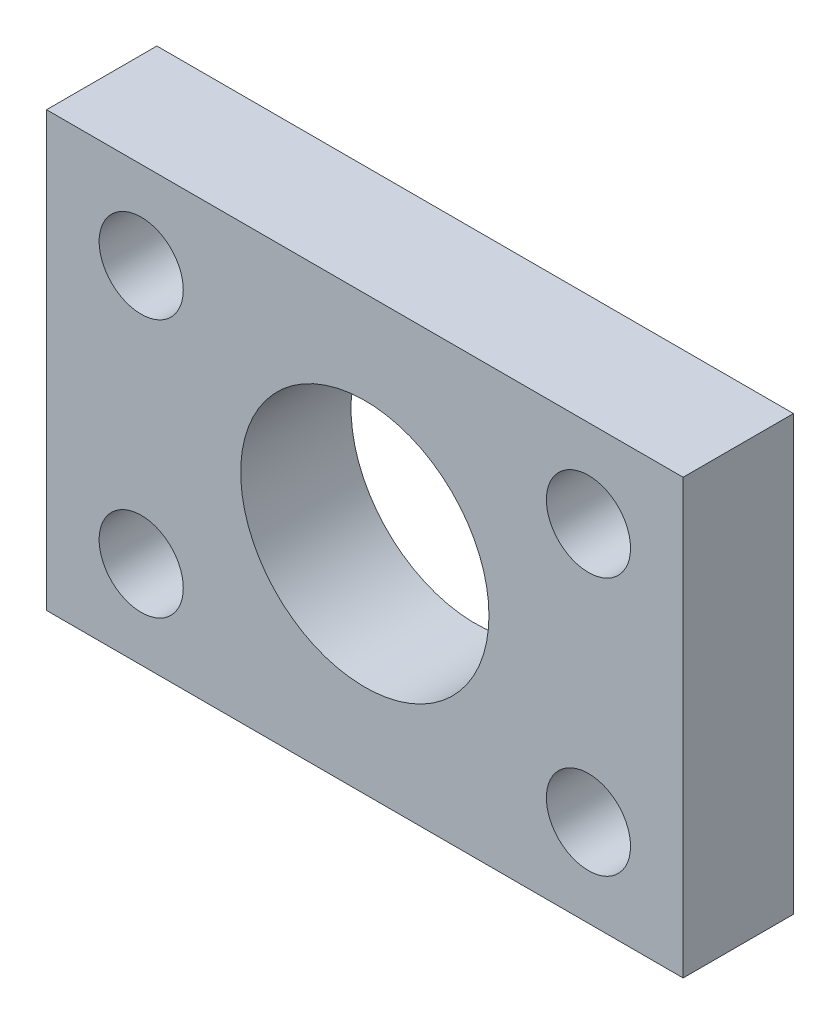
ISO-10303-21;
HEADER;
FILE_DESCRIPTION(('STEP AP214'),'2;1');
FILE_NAME('part.step','',(''),(''),'','','');
FILE_SCHEMA(('AUTOMOTIVE_DESIGN { 1 0 10303 214 1 1 1 1 }'));
ENDSEC;
DATA;
#1=APPLICATION_CONTEXT('core data for automotive mechanical design processes');
#2=APPLICATION_PROTOCOL_DEFINITION('international standard','automotive_design',2000,#1);
#3=PRODUCT_CONTEXT('',#1,'mechanical');
#4=PRODUCT('Part','Part','',(#3));
#5=PRODUCT_RELATED_PRODUCT_CATEGORY('part','',(#4));
#6=PRODUCT_DEFINITION_FORMATION('','',#4);
#7=PRODUCT_DEFINITION_CONTEXT('part definition',#1,'design');
#8=PRODUCT_DEFINITION('design','',#6,#7);
#9=PRODUCT_DEFINITION_SHAPE('','',#8);
#10=(LENGTH_UNIT() NAMED_UNIT(*) SI_UNIT(.MILLI.,.METRE.));
#11=(NAMED_UNIT(*) PLANE_ANGLE_UNIT() SI_UNIT($,.RADIAN.));
#12=(NAMED_UNIT(*) SI_UNIT($,.STERADIAN.) SOLID_ANGLE_UNIT());
#13=UNCERTAINTY_MEASURE_WITH_UNIT(LENGTH_MEASURE(1.E-05),#10,'distance_accuracy_value','');
#14=(GEOMETRIC_REPRESENTATION_CONTEXT(3) GLOBAL_UNCERTAINTY_ASSIGNED_CONTEXT((#13)) GLOBAL_UNIT_ASSIGNED_CONTEXT((#10,
#11,#12)) REPRESENTATION_CONTEXT('',''));
#15=CARTESIAN_POINT('',(0.,0.,0.));
#16=DIRECTION('',(0.,0.,1.));
#17=DIRECTION('',(1.,0.,0.));
#18=AXIS2_PLACEMENT_3D('',#15,#16,#17);
#19=CARTESIAN_POINT('',(0.,-7.86,4.));
#20=DIRECTION('',(0.,1.,0.));
#21=DIRECTION('',(0.,0.,1.));
#22=AXIS2_PLACEMENT_3D('',#19,#20,#21);
#23=PLANE('',#22);
#24=DIRECTION('',(1.,0.,0.));
#25=VECTOR('',#24,1.);
#26=CARTESIAN_POINT('',(0.,-7.86,0.));
#27=LINE('',#26,#25);
#28=CARTESIAN_POINT('',(-11.5379731158305,-7.86,0.));
#29=VERTEX_POINT('',#28);
#30=CARTESIAN_POINT('',(11.5379731158305,-7.86,0.));
#31=VERTEX_POINT('',#30);
#32=EDGE_CURVE('E131',#29,#31,#27,.T.);
#33=ORIENTED_EDGE('',*,*,#32,.T.);
#34=DIRECTION('',(0.,0.,-1.));
#35=VECTOR('',#34,1.);
#36=CARTESIAN_POINT('',(11.5379731158305,-7.86,4.));
#37=LINE('',#36,#35);
#38=CARTESIAN_POINT('',(11.5379731158305,-7.86,4.));
#39=VERTEX_POINT('',#38);
#40=EDGE_CURVE('E11',#39,#31,#37,.T.);
#41=ORIENTED_EDGE('',*,*,#40,.F.);
#42=DIRECTION('',(1.,0.,0.));
#43=VECTOR('',#42,1.);
#44=CARTESIAN_POINT('',(0.,-7.86,4.));
#45=LINE('',#44,#43);
#46=CARTESIAN_POINT('',(-11.5379731158305,-7.86,4.));
#47=VERTEX_POINT('',#46);
#48=EDGE_CURVE('E93',#47,#39,#45,.T.);
#49=ORIENTED_EDGE('',*,*,#48,.F.);
#50=DIRECTION('',(0.,0.,-1.));
#51=VECTOR('',#50,1.);
#52=CARTESIAN_POINT('',(-11.5379731158305,-7.86,4.));
#53=LINE('',#52,#51);
#54=EDGE_CURVE('E59',#47,#29,#53,.T.);
#55=ORIENTED_EDGE('',*,*,#54,.T.);
#56=EDGE_LOOP('',(#33,#41,#49,#55));
#57=FACE_BOUND('',#56,.T.);
#58=ADVANCED_FACE('F41',(#57),#23,.F.);
#59=CARTESIAN_POINT('',(11.5379731158305,0.,4.));
#60=DIRECTION('',(-1.,0.,0.));
#61=DIRECTION('',(0.,-1.,0.));
#62=AXIS2_PLACEMENT_3D('',#59,#60,#61);
#63=PLANE('',#62);
#64=DIRECTION('',(0.,1.,0.));
#65=VECTOR('',#64,1.);
#66=CARTESIAN_POINT('',(11.5379731158305,0.,0.));
#67=LINE('',#66,#65);
#68=CARTESIAN_POINT('',(11.5379731158305,7.86,0.));
#69=VERTEX_POINT('',#68);
#70=EDGE_CURVE('E99',#31,#69,#67,.T.);
#71=ORIENTED_EDGE('',*,*,#70,.T.);
#72=DIRECTION('',(0.,0.,-1.));
#73=VECTOR('',#72,1.);
#74=CARTESIAN_POINT('',(11.5379731158305,7.86,4.));
#75=LINE('',#74,#73);
#76=CARTESIAN_POINT('',(11.5379731158305,7.86,4.));
#77=VERTEX_POINT('',#76);
#78=EDGE_CURVE('E51',#77,#69,#75,.T.);
#79=ORIENTED_EDGE('',*,*,#78,.F.);
#80=DIRECTION('',(0.,1.,0.));
#81=VECTOR('',#80,1.);
#82=CARTESIAN_POINT('',(11.5379731158305,0.,4.));
#83=LINE('',#82,#81);
#84=EDGE_CURVE('E84',#39,#77,#83,.T.);
#85=ORIENTED_EDGE('',*,*,#84,.F.);
#86=ORIENTED_EDGE('',*,*,#40,.T.);
#87=EDGE_LOOP('',(#71,#79,#85,#86));
#88=FACE_BOUND('',#87,.T.);
#89=ADVANCED_FACE('F98',(#88),#63,.F.);
#90=CARTESIAN_POINT('',(0.,7.86,4.));
#91=DIRECTION('',(0.,1.,0.));
#92=DIRECTION('',(-1.,0.,0.));
#93=AXIS2_PLACEMENT_3D('',#90,#91,#92);
#94=PLANE('',#93);
#95=DIRECTION('',(1.,0.,0.));
#96=VECTOR('',#95,1.);
#97=CARTESIAN_POINT('',(0.,7.86,0.));
#98=LINE('',#97,#96);
#99=CARTESIAN_POINT('',(-11.5379731158305,7.86,0.));
#100=VERTEX_POINT('',#99);
#101=EDGE_CURVE('E136',#100,#69,#98,.T.);
#102=ORIENTED_EDGE('',*,*,#101,.F.);
#103=DIRECTION('',(0.,0.,-1.));
#104=VECTOR('',#103,1.);
#105=CARTESIAN_POINT('',(-11.5379731158305,7.86,4.));
#106=LINE('',#105,#104);
#107=CARTESIAN_POINT('',(-11.5379731158305,7.86,4.));
#108=VERTEX_POINT('',#107);
#109=EDGE_CURVE('E73',#108,#100,#106,.T.);
#110=ORIENTED_EDGE('',*,*,#109,.F.);
#111=DIRECTION('',(1.,0.,0.));
#112=VECTOR('',#111,1.);
#113=CARTESIAN_POINT('',(0.,7.86,4.));
#114=LINE('',#113,#112);
#115=EDGE_CURVE('E92',#108,#77,#114,.T.);
#116=ORIENTED_EDGE('',*,*,#115,.T.);
#117=ORIENTED_EDGE('',*,*,#78,.T.);
#118=EDGE_LOOP('',(#102,#110,#116,#117));
#119=FACE_BOUND('',#118,.T.);
#120=ADVANCED_FACE('F103',(#119),#94,.T.);
#121=CARTESIAN_POINT('',(-11.5379731158305,0.,4.));
#122=DIRECTION('',(-1.,0.,0.));
#123=DIRECTION('',(0.,0.,1.));
#124=AXIS2_PLACEMENT_3D('',#121,#122,#123);
#125=PLANE('',#124);
#126=DIRECTION('',(0.,1.,0.));
#127=VECTOR('',#126,1.);
#128=CARTESIAN_POINT('',(-11.5379731158305,0.,0.));
#129=LINE('',#128,#127);
#130=EDGE_CURVE('E139',#29,#100,#129,.T.);
#131=ORIENTED_EDGE('',*,*,#130,.F.);
#132=ORIENTED_EDGE('',*,*,#54,.F.);
#133=DIRECTION('',(0.,1.,0.));
#134=VECTOR('',#133,1.);
#135=CARTESIAN_POINT('',(-11.5379731158305,0.,4.));
#136=LINE('',#135,#134);
#137=EDGE_CURVE('E105',#47,#108,#136,.T.);
#138=ORIENTED_EDGE('',*,*,#137,.T.);
#139=ORIENTED_EDGE('',*,*,#109,.T.);
#140=EDGE_LOOP('',(#131,#132,#138,#139));
#141=FACE_BOUND('',#140,.T.);
#142=ADVANCED_FACE('F201',(#141),#125,.T.);
#143=CARTESIAN_POINT('',(-8.10599777942235,4.68,4.));
#144=DIRECTION('',(0.,0.,-1.));
#145=DIRECTION('',(-1.,0.,0.));
#146=AXIS2_PLACEMENT_3D('',#143,#144,#145);
#147=CYLINDRICAL_SURFACE('',#146,1.525);
#148=CARTESIAN_POINT('',(-8.10599777942235,4.68,4.));
#149=DIRECTION('',(0.,0.,1.));
#150=DIRECTION('',(1.,0.,0.));
#151=AXIS2_PLACEMENT_3D('',#148,#149,#150);
#152=CIRCLE('',#151,1.525);
#153=CARTESIAN_POINT('',(-6.58099777942235,4.68,4.));
#154=VERTEX_POINT('',#153);
#155=EDGE_CURVE('E167',#154,#154,#152,.T.);
#156=ORIENTED_EDGE('',*,*,#155,.T.);
#157=EDGE_LOOP('',(#156));
#158=FACE_BOUND('',#157,.T.);
#159=CARTESIAN_POINT('',(-8.10599777942235,4.68,0.));
#160=DIRECTION('',(0.,0.,1.));
#161=DIRECTION('',(1.,0.,0.));
#162=AXIS2_PLACEMENT_3D('',#159,#160,#161);
#163=CIRCLE('',#162,1.525);
#164=CARTESIAN_POINT('',(-6.58099777942235,4.68,0.));
#165=VERTEX_POINT('',#164);
#166=EDGE_CURVE('E127',#165,#165,#163,.T.);
#167=ORIENTED_EDGE('',*,*,#166,.F.);
#168=EDGE_LOOP('',(#167));
#169=FACE_BOUND('',#168,.T.);
#170=ADVANCED_FACE('F173',(#158,#169),#147,.F.);
#171=CARTESIAN_POINT('',(8.10599777942235,4.68,4.));
#172=DIRECTION('',(0.,0.,-1.));
#173=DIRECTION('',(-1.,0.,0.));
#174=AXIS2_PLACEMENT_3D('',#171,#172,#173);
#175=CYLINDRICAL_SURFACE('',#174,1.525);
#176=CARTESIAN_POINT('',(8.10599777942235,4.68,4.));
#177=DIRECTION('',(0.,0.,1.));
#178=DIRECTION('',(1.,0.,0.));
#179=AXIS2_PLACEMENT_3D('',#176,#177,#178);
#180=CIRCLE('',#179,1.525);
#181=CARTESIAN_POINT('',(9.63099777942235,4.68,4.));
#182=VERTEX_POINT('',#181);
#183=EDGE_CURVE('E161',#182,#182,#180,.T.);
#184=ORIENTED_EDGE('',*,*,#183,.T.);
#185=EDGE_LOOP('',(#184));
#186=FACE_BOUND('',#185,.T.);
#187=CARTESIAN_POINT('',(8.10599777942235,4.68,0.));
#188=DIRECTION('',(0.,0.,1.));
#189=DIRECTION('',(1.,0.,0.));
#190=AXIS2_PLACEMENT_3D('',#187,#188,#189);
#191=CIRCLE('',#190,1.525);
#192=CARTESIAN_POINT('',(9.63099777942235,4.68,0.));
#193=VERTEX_POINT('',#192);
#194=EDGE_CURVE('E123',#193,#193,#191,.T.);
#195=ORIENTED_EDGE('',*,*,#194,.F.);
#196=EDGE_LOOP('',(#195));
#197=FACE_BOUND('',#196,.T.);
#198=ADVANCED_FACE('F200',(#186,#197),#175,.F.);
#199=CARTESIAN_POINT('',(8.10599777942235,-4.68,4.));
#200=DIRECTION('',(0.,0.,-1.));
#201=DIRECTION('',(-1.,0.,0.));
#202=AXIS2_PLACEMENT_3D('',#199,#200,#201);
#203=CYLINDRICAL_SURFACE('',#202,1.525);
#204=CARTESIAN_POINT('',(8.10599777942235,-4.68,4.));
#205=DIRECTION('',(0.,0.,1.));
#206=DIRECTION('',(1.,0.,0.));
#207=AXIS2_PLACEMENT_3D('',#204,#205,#206);
#208=CIRCLE('',#207,1.525);
#209=CARTESIAN_POINT('',(9.63099777942235,-4.68,4.));
#210=VERTEX_POINT('',#209);
#211=EDGE_CURVE('E155',#210,#210,#208,.T.);
#212=ORIENTED_EDGE('',*,*,#211,.T.);
#213=EDGE_LOOP('',(#212));
#214=FACE_BOUND('',#213,.T.);
#215=CARTESIAN_POINT('',(8.10599777942235,-4.68,0.));
#216=DIRECTION('',(0.,0.,1.));
#217=DIRECTION('',(1.,0.,0.));
#218=AXIS2_PLACEMENT_3D('',#215,#216,#217);
#219=CIRCLE('',#218,1.525);
#220=CARTESIAN_POINT('',(9.63099777942235,-4.68,0.));
#221=VERTEX_POINT('',#220);
#222=EDGE_CURVE('E119',#221,#221,#219,.T.);
#223=ORIENTED_EDGE('',*,*,#222,.F.);
#224=EDGE_LOOP('',(#223));
#225=FACE_BOUND('',#224,.T.);
#226=ADVANCED_FACE('F203',(#214,#225),#203,.F.);
#227=CARTESIAN_POINT('',(-8.10599777942235,-4.68,4.));
#228=DIRECTION('',(0.,0.,-1.));
#229=DIRECTION('',(-1.,0.,0.));
#230=AXIS2_PLACEMENT_3D('',#227,#228,#229);
#231=CYLINDRICAL_SURFACE('',#230,1.525);
#232=CARTESIAN_POINT('',(-8.10599777942235,-4.68,4.));
#233=DIRECTION('',(0.,0.,1.));
#234=DIRECTION('',(1.,0.,0.));
#235=AXIS2_PLACEMENT_3D('',#232,#233,#234);
#236=CIRCLE('',#235,1.525);
#237=CARTESIAN_POINT('',(-6.58099777942235,-4.68,4.));
#238=VERTEX_POINT('',#237);
#239=EDGE_CURVE('E147',#238,#238,#236,.T.);
#240=ORIENTED_EDGE('',*,*,#239,.T.);
#241=EDGE_LOOP('',(#240));
#242=FACE_BOUND('',#241,.T.);
#243=CARTESIAN_POINT('',(-8.10599777942235,-4.68,0.));
#244=DIRECTION('',(0.,0.,1.));
#245=DIRECTION('',(1.,0.,0.));
#246=AXIS2_PLACEMENT_3D('',#243,#244,#245);
#247=CIRCLE('',#246,1.525);
#248=CARTESIAN_POINT('',(-6.58099777942235,-4.68,0.));
#249=VERTEX_POINT('',#248);
#250=EDGE_CURVE('E115',#249,#249,#247,.T.);
#251=ORIENTED_EDGE('',*,*,#250,.F.);
#252=EDGE_LOOP('',(#251));
#253=FACE_BOUND('',#252,.T.);
#254=ADVANCED_FACE('F43',(#242,#253),#231,.F.);
#255=CARTESIAN_POINT('',(0.,0.,4.));
#256=DIRECTION('',(0.,0.,-1.));
#257=DIRECTION('',(-1.,0.,0.));
#258=AXIS2_PLACEMENT_3D('',#255,#256,#257);
#259=CYLINDRICAL_SURFACE('',#258,4.5);
#260=CARTESIAN_POINT('',(0.,0.,4.));
#261=DIRECTION('',(0.,0.,1.));
#262=DIRECTION('',(1.,0.,0.));
#263=AXIS2_PLACEMENT_3D('',#260,#261,#262);
#264=CIRCLE('',#263,4.5);
#265=CARTESIAN_POINT('',(4.5,0.,4.));
#266=VERTEX_POINT('',#265);
#267=EDGE_CURVE('E108',#266,#266,#264,.T.);
#268=ORIENTED_EDGE('',*,*,#267,.T.);
#269=EDGE_LOOP('',(#268));
#270=FACE_BOUND('',#269,.T.);
#271=CARTESIAN_POINT('',(0.,0.,0.));
#272=DIRECTION('',(0.,0.,1.));
#273=DIRECTION('',(1.,0.,0.));
#274=AXIS2_PLACEMENT_3D('',#271,#272,#273);
#275=CIRCLE('',#274,4.5);
#276=CARTESIAN_POINT('',(4.5,0.,0.));
#277=VERTEX_POINT('',#276);
#278=EDGE_CURVE('E143',#277,#277,#275,.T.);
#279=ORIENTED_EDGE('',*,*,#278,.F.);
#280=EDGE_LOOP('',(#279));
#281=FACE_BOUND('',#280,.T.);
#282=ADVANCED_FACE('F178',(#270,#281),#259,.F.);
#283=CARTESIAN_POINT('',(0.,0.,4.));
#284=DIRECTION('',(0.,0.,1.));
#285=DIRECTION('',(1.,0.,0.));
#286=AXIS2_PLACEMENT_3D('',#283,#284,#285);
#287=PLANE('',#286);
#288=ORIENTED_EDGE('',*,*,#239,.F.);
#289=EDGE_LOOP('',(#288));
#290=FACE_BOUND('',#289,.T.);
#291=ORIENTED_EDGE('',*,*,#211,.F.);
#292=EDGE_LOOP('',(#291));
#293=FACE_BOUND('',#292,.T.);
#294=ORIENTED_EDGE('',*,*,#183,.F.);
#295=EDGE_LOOP('',(#294));
#296=FACE_BOUND('',#295,.T.);
#297=ORIENTED_EDGE('',*,*,#155,.F.);
#298=EDGE_LOOP('',(#297));
#299=FACE_BOUND('',#298,.T.);
#300=ORIENTED_EDGE('',*,*,#48,.T.);
#301=ORIENTED_EDGE('',*,*,#84,.T.);
#302=ORIENTED_EDGE('',*,*,#115,.F.);
#303=ORIENTED_EDGE('',*,*,#137,.F.);
#304=EDGE_LOOP('',(#300,#301,#302,#303));
#305=FACE_BOUND('',#304,.T.);
#306=ORIENTED_EDGE('',*,*,#267,.F.);
#307=EDGE_LOOP('',(#306));
#308=FACE_BOUND('',#307,.T.);
#309=ADVANCED_FACE('F88',(#290,#293,#296,#299,#305,#308),#287,.T.);
#310=CARTESIAN_POINT('',(0.,0.,0.));
#311=DIRECTION('',(0.,0.,1.));
#312=DIRECTION('',(1.,0.,0.));
#313=AXIS2_PLACEMENT_3D('',#310,#311,#312);
#314=PLANE('',#313);
#315=ORIENTED_EDGE('',*,*,#250,.T.);
#316=EDGE_LOOP('',(#315));
#317=FACE_BOUND('',#316,.T.);
#318=ORIENTED_EDGE('',*,*,#222,.T.);
#319=EDGE_LOOP('',(#318));
#320=FACE_BOUND('',#319,.T.);
#321=ORIENTED_EDGE('',*,*,#194,.T.);
#322=EDGE_LOOP('',(#321));
#323=FACE_BOUND('',#322,.T.);
#324=ORIENTED_EDGE('',*,*,#166,.T.);
#325=EDGE_LOOP('',(#324));
#326=FACE_BOUND('',#325,.T.);
#327=ORIENTED_EDGE('',*,*,#32,.F.);
#328=ORIENTED_EDGE('',*,*,#130,.T.);
#329=ORIENTED_EDGE('',*,*,#101,.T.);
#330=ORIENTED_EDGE('',*,*,#70,.F.);
#331=EDGE_LOOP('',(#327,#328,#329,#330));
#332=FACE_BOUND('',#331,.T.);
#333=ORIENTED_EDGE('',*,*,#278,.T.);
#334=EDGE_LOOP('',(#333));
#335=FACE_BOUND('',#334,.T.);
#336=ADVANCED_FACE('F177',(#317,#320,#323,#326,#332,#335),#314,.F.);
#337=CLOSED_SHELL('',(#58,#89,#120,#142,#170,#198,#226,#254,#282,#309,#336));
#338=MANIFOLD_SOLID_BREP('B2',#337);
#339=ADVANCED_BREP_SHAPE_REPRESENTATION('',(#18,#338),#14);
#340=SHAPE_DEFINITION_REPRESENTATION(#9,#339);
ENDSEC;
END-ISO-10303-21;
